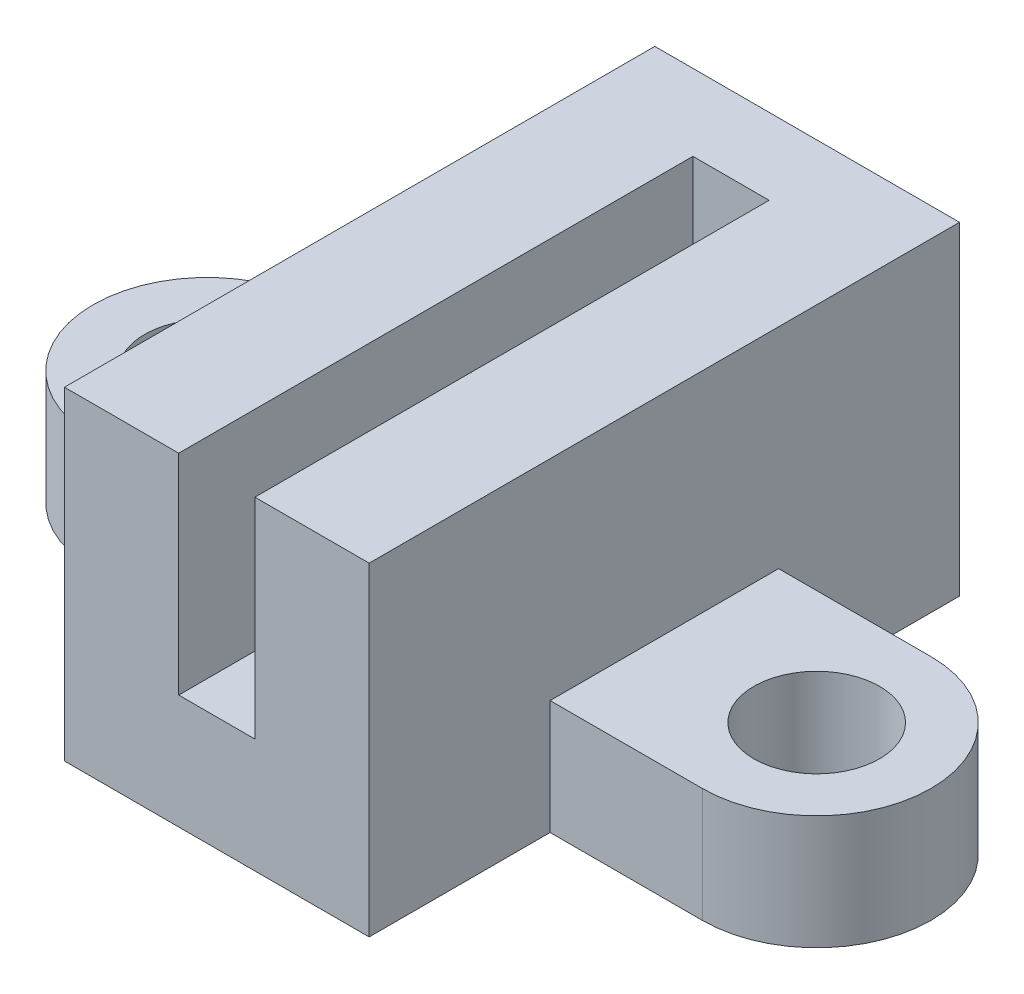
ISO-10303-21;
HEADER;
FILE_DESCRIPTION(('STEP AP214'),'2;1');
FILE_NAME('part.step','',(''),(''),'','','');
FILE_SCHEMA(('AUTOMOTIVE_DESIGN { 1 0 10303 214 1 1 1 1 }'));
ENDSEC;
DATA;
#1=APPLICATION_CONTEXT('core data for automotive mechanical design processes');
#2=APPLICATION_PROTOCOL_DEFINITION('international standard','automotive_design',2000,#1);
#3=PRODUCT_CONTEXT('',#1,'mechanical');
#4=PRODUCT('Part','Part','',(#3));
#5=PRODUCT_RELATED_PRODUCT_CATEGORY('part','',(#4));
#6=PRODUCT_DEFINITION_FORMATION('','',#4);
#7=PRODUCT_DEFINITION_CONTEXT('part definition',#1,'design');
#8=PRODUCT_DEFINITION('design','',#6,#7);
#9=PRODUCT_DEFINITION_SHAPE('','',#8);
#10=(LENGTH_UNIT() NAMED_UNIT(*) SI_UNIT(.MILLI.,.METRE.));
#11=(NAMED_UNIT(*) PLANE_ANGLE_UNIT() SI_UNIT($,.RADIAN.));
#12=(NAMED_UNIT(*) SI_UNIT($,.STERADIAN.) SOLID_ANGLE_UNIT());
#13=UNCERTAINTY_MEASURE_WITH_UNIT(LENGTH_MEASURE(1.E-05),#10,'distance_accuracy_value','');
#14=(GEOMETRIC_REPRESENTATION_CONTEXT(3) GLOBAL_UNCERTAINTY_ASSIGNED_CONTEXT((#13)) GLOBAL_UNIT_ASSIGNED_CONTEXT((#10,
#11,#12)) REPRESENTATION_CONTEXT('',''));
#15=CARTESIAN_POINT('',(0.,0.,0.));
#16=DIRECTION('',(0.,0.,1.));
#17=DIRECTION('',(1.,0.,0.));
#18=AXIS2_PLACEMENT_3D('',#15,#16,#17);
#19=CARTESIAN_POINT('',(8.,8.5,13.5));
#20=DIRECTION('',(-1.,0.,0.));
#21=DIRECTION('',(0.,-1.,0.));
#22=AXIS2_PLACEMENT_3D('',#19,#20,#21);
#23=PLANE('',#22);
#24=DIRECTION('',(0.,-1.,0.));
#25=VECTOR('',#24,1.);
#26=CARTESIAN_POINT('',(8.,3.,8.75));
#27=LINE('',#26,#25);
#28=CARTESIAN_POINT('',(8.,3.,8.75));
#29=VERTEX_POINT('',#28);
#30=CARTESIAN_POINT('',(8.,0.,8.75));
#31=VERTEX_POINT('',#30);
#32=EDGE_CURVE('E154',#29,#31,#27,.T.);
#33=ORIENTED_EDGE('',*,*,#32,.F.);
#34=DIRECTION('',(0.,0.,1.));
#35=VECTOR('',#34,1.);
#36=CARTESIAN_POINT('',(8.,3.,8.75));
#37=LINE('',#36,#35);
#38=CARTESIAN_POINT('',(8.,3.,2.75));
#39=VERTEX_POINT('',#38);
#40=EDGE_CURVE('E160',#39,#29,#37,.T.);
#41=ORIENTED_EDGE('',*,*,#40,.F.);
#42=DIRECTION('',(0.,-1.,0.));
#43=VECTOR('',#42,1.);
#44=CARTESIAN_POINT('',(8.,3.,2.75));
#45=LINE('',#44,#43);
#46=CARTESIAN_POINT('',(8.,0.,2.75));
#47=VERTEX_POINT('',#46);
#48=EDGE_CURVE('E271',#39,#47,#45,.T.);
#49=ORIENTED_EDGE('',*,*,#48,.T.);
#50=DIRECTION('',(0.,0.,-1.));
#51=VECTOR('',#50,1.);
#52=CARTESIAN_POINT('',(8.,0.,13.5));
#53=LINE('',#52,#51);
#54=CARTESIAN_POINT('',(8.,0.,-2.));
#55=VERTEX_POINT('',#54);
#56=EDGE_CURVE('E41',#47,#55,#53,.T.);
#57=ORIENTED_EDGE('',*,*,#56,.T.);
#58=DIRECTION('',(0.,-1.,0.));
#59=VECTOR('',#58,1.);
#60=CARTESIAN_POINT('',(8.,0.,-2.));
#61=LINE('',#60,#59);
#62=CARTESIAN_POINT('',(8.,8.5,-2.));
#63=VERTEX_POINT('',#62);
#64=EDGE_CURVE('E206',#63,#55,#61,.T.);
#65=ORIENTED_EDGE('',*,*,#64,.F.);
#66=DIRECTION('',(0.,0.,-1.));
#67=VECTOR('',#66,1.);
#68=CARTESIAN_POINT('',(8.,8.5,13.5));
#69=LINE('',#68,#67);
#70=CARTESIAN_POINT('',(8.,8.5,13.5));
#71=VERTEX_POINT('',#70);
#72=EDGE_CURVE('E263',#71,#63,#69,.T.);
#73=ORIENTED_EDGE('',*,*,#72,.F.);
#74=DIRECTION('',(0.,1.,0.));
#75=VECTOR('',#74,1.);
#76=CARTESIAN_POINT('',(8.,8.5,13.5));
#77=LINE('',#76,#75);
#78=CARTESIAN_POINT('',(8.,0.,13.5));
#79=VERTEX_POINT('',#78);
#80=EDGE_CURVE('E224',#79,#71,#77,.T.);
#81=ORIENTED_EDGE('',*,*,#80,.F.);
#82=EDGE_CURVE('E11',#79,#31,#53,.T.);
#83=ORIENTED_EDGE('',*,*,#82,.T.);
#84=EDGE_LOOP('',(#33,#41,#49,#57,#65,#73,#81,#83));
#85=FACE_BOUND('',#84,.T.);
#86=ADVANCED_FACE('F33',(#85),#23,.F.);
#87=CARTESIAN_POINT('',(0.,0.,13.5));
#88=DIRECTION('',(1.,0.,0.));
#89=DIRECTION('',(0.,0.,-1.));
#90=AXIS2_PLACEMENT_3D('',#87,#88,#89);
#91=PLANE('',#90);
#92=DIRECTION('',(0.,-1.,0.));
#93=VECTOR('',#92,1.);
#94=CARTESIAN_POINT('',(0.,3.,2.75));
#95=LINE('',#94,#93);
#96=CARTESIAN_POINT('',(0.,3.,2.75));
#97=VERTEX_POINT('',#96);
#98=CARTESIAN_POINT('',(0.,0.,2.75));
#99=VERTEX_POINT('',#98);
#100=EDGE_CURVE('E202',#97,#99,#95,.T.);
#101=ORIENTED_EDGE('',*,*,#100,.F.);
#102=DIRECTION('',(0.,0.,-1.));
#103=VECTOR('',#102,1.);
#104=CARTESIAN_POINT('',(0.,3.,2.75));
#105=LINE('',#104,#103);
#106=CARTESIAN_POINT('',(0.,3.,8.75));
#107=VERTEX_POINT('',#106);
#108=EDGE_CURVE('E182',#107,#97,#105,.T.);
#109=ORIENTED_EDGE('',*,*,#108,.F.);
#110=DIRECTION('',(0.,-1.,0.));
#111=VECTOR('',#110,1.);
#112=CARTESIAN_POINT('',(0.,3.,8.75));
#113=LINE('',#112,#111);
#114=CARTESIAN_POINT('',(0.,0.,8.75));
#115=VERTEX_POINT('',#114);
#116=EDGE_CURVE('E191',#107,#115,#113,.T.);
#117=ORIENTED_EDGE('',*,*,#116,.T.);
#118=DIRECTION('',(0.,0.,-1.));
#119=VECTOR('',#118,1.);
#120=CARTESIAN_POINT('',(0.,0.,13.5));
#121=LINE('',#120,#119);
#122=CARTESIAN_POINT('',(0.,0.,13.5));
#123=VERTEX_POINT('',#122);
#124=EDGE_CURVE('E247',#123,#115,#121,.T.);
#125=ORIENTED_EDGE('',*,*,#124,.F.);
#126=DIRECTION('',(0.,-1.,0.));
#127=VECTOR('',#126,1.);
#128=CARTESIAN_POINT('',(0.,0.,13.5));
#129=LINE('',#128,#127);
#130=CARTESIAN_POINT('',(0.,8.5,13.5));
#131=VERTEX_POINT('',#130);
#132=EDGE_CURVE('E237',#131,#123,#129,.T.);
#133=ORIENTED_EDGE('',*,*,#132,.F.);
#134=DIRECTION('',(0.,0.,-1.));
#135=VECTOR('',#134,1.);
#136=CARTESIAN_POINT('',(0.,8.5,13.5));
#137=LINE('',#136,#135);
#138=CARTESIAN_POINT('',(0.,8.5,-2.));
#139=VERTEX_POINT('',#138);
#140=EDGE_CURVE('E250',#131,#139,#137,.T.);
#141=ORIENTED_EDGE('',*,*,#140,.T.);
#142=DIRECTION('',(0.,1.,0.));
#143=VECTOR('',#142,1.);
#144=CARTESIAN_POINT('',(0.,0.,-2.));
#145=LINE('',#144,#143);
#146=CARTESIAN_POINT('',(0.,0.,-2.));
#147=VERTEX_POINT('',#146);
#148=EDGE_CURVE('E212',#147,#139,#145,.T.);
#149=ORIENTED_EDGE('',*,*,#148,.F.);
#150=EDGE_CURVE('E239',#99,#147,#121,.T.);
#151=ORIENTED_EDGE('',*,*,#150,.F.);
#152=EDGE_LOOP('',(#101,#109,#117,#125,#133,#141,#149,#151));
#153=FACE_BOUND('',#152,.T.);
#154=ADVANCED_FACE('F285',(#153),#91,.F.);
#155=CARTESIAN_POINT('',(8.,0.,13.5));
#156=DIRECTION('',(0.,1.,0.));
#157=DIRECTION('',(-1.,0.,0.));
#158=AXIS2_PLACEMENT_3D('',#155,#156,#157);
#159=PLANE('',#158);
#160=ORIENTED_EDGE('',*,*,#124,.T.);
#161=DIRECTION('',(1.,0.,0.));
#162=VECTOR('',#161,1.);
#163=CARTESIAN_POINT('',(-4.,0.,8.75));
#164=LINE('',#163,#162);
#165=CARTESIAN_POINT('',(-4.,0.,8.75));
#166=VERTEX_POINT('',#165);
#167=EDGE_CURVE('E56',#166,#115,#164,.T.);
#168=ORIENTED_EDGE('',*,*,#167,.F.);
#169=CARTESIAN_POINT('',(-4.,0.,5.75));
#170=DIRECTION('',(0.,1.,0.));
#171=DIRECTION('',(0.,0.,1.));
#172=AXIS2_PLACEMENT_3D('',#169,#170,#171);
#173=CIRCLE('',#172,3.);
#174=CARTESIAN_POINT('',(-4.,0.,2.75));
#175=VERTEX_POINT('',#174);
#176=EDGE_CURVE('E193',#175,#166,#173,.T.);
#177=ORIENTED_EDGE('',*,*,#176,.F.);
#178=DIRECTION('',(-1.,0.,0.));
#179=VECTOR('',#178,1.);
#180=CARTESIAN_POINT('',(0.,0.,2.75));
#181=LINE('',#180,#179);
#182=EDGE_CURVE('E180',#99,#175,#181,.T.);
#183=ORIENTED_EDGE('',*,*,#182,.F.);
#184=ORIENTED_EDGE('',*,*,#150,.T.);
#185=DIRECTION('',(-1.,0.,0.));
#186=VECTOR('',#185,1.);
#187=CARTESIAN_POINT('',(8.,0.,-2.));
#188=LINE('',#187,#186);
#189=EDGE_CURVE('E209',#55,#147,#188,.T.);
#190=ORIENTED_EDGE('',*,*,#189,.F.);
#191=ORIENTED_EDGE('',*,*,#56,.F.);
#192=DIRECTION('',(-1.,0.,0.));
#193=VECTOR('',#192,1.);
#194=CARTESIAN_POINT('',(8.,0.,2.75));
#195=LINE('',#194,#193);
#196=CARTESIAN_POINT('',(12.,0.,2.75));
#197=VERTEX_POINT('',#196);
#198=EDGE_CURVE('E48',#197,#47,#195,.T.);
#199=ORIENTED_EDGE('',*,*,#198,.F.);
#200=CARTESIAN_POINT('',(12.,0.,5.75));
#201=DIRECTION('',(0.,1.,0.));
#202=DIRECTION('',(0.,0.,-1.));
#203=AXIS2_PLACEMENT_3D('',#200,#201,#202);
#204=CIRCLE('',#203,3.);
#205=CARTESIAN_POINT('',(12.,0.,8.75));
#206=VERTEX_POINT('',#205);
#207=EDGE_CURVE('E504',#206,#197,#204,.T.);
#208=ORIENTED_EDGE('',*,*,#207,.F.);
#209=DIRECTION('',(1.,0.,0.));
#210=VECTOR('',#209,1.);
#211=CARTESIAN_POINT('',(12.,0.,8.75));
#212=LINE('',#211,#210);
#213=EDGE_CURVE('E498',#31,#206,#212,.T.);
#214=ORIENTED_EDGE('',*,*,#213,.F.);
#215=ORIENTED_EDGE('',*,*,#82,.F.);
#216=DIRECTION('',(1.,0.,0.));
#217=VECTOR('',#216,1.);
#218=CARTESIAN_POINT('',(8.,0.,13.5));
#219=LINE('',#218,#217);
#220=EDGE_CURVE('E221',#123,#79,#219,.T.);
#221=ORIENTED_EDGE('',*,*,#220,.F.);
#222=EDGE_LOOP('',(#160,#168,#177,#183,#184,#190,#191,#199,#208,#214,#215,#221));
#223=FACE_BOUND('',#222,.T.);
#224=CARTESIAN_POINT('',(-4.,0.,5.75));
#225=DIRECTION('',(0.,1.,0.));
#226=DIRECTION('',(0.,0.,1.));
#227=AXIS2_PLACEMENT_3D('',#224,#225,#226);
#228=CIRCLE('',#227,1.65);
#229=CARTESIAN_POINT('',(-4.,0.,7.4));
#230=VERTEX_POINT('',#229);
#231=EDGE_CURVE('E170',#230,#230,#228,.T.);
#232=ORIENTED_EDGE('',*,*,#231,.T.);
#233=EDGE_LOOP('',(#232));
#234=FACE_BOUND('',#233,.T.);
#235=CARTESIAN_POINT('',(12.,0.,5.75));
#236=DIRECTION('',(0.,1.,0.));
#237=DIRECTION('',(0.,0.,1.));
#238=AXIS2_PLACEMENT_3D('',#235,#236,#237);
#239=CIRCLE('',#238,1.65);
#240=CARTESIAN_POINT('',(12.,0.,7.4));
#241=VERTEX_POINT('',#240);
#242=EDGE_CURVE('E495',#241,#241,#239,.T.);
#243=ORIENTED_EDGE('',*,*,#242,.T.);
#244=EDGE_LOOP('',(#243));
#245=FACE_BOUND('',#244,.T.);
#246=ADVANCED_FACE('F35',(#223,#234,#245),#159,.F.);
#247=CARTESIAN_POINT('',(5.,3.,13.5));
#248=DIRECTION('',(1.,0.,0.));
#249=DIRECTION('',(0.,1.,0.));
#250=AXIS2_PLACEMENT_3D('',#247,#248,#249);
#251=PLANE('',#250);
#252=DIRECTION('',(0.,-1.,0.));
#253=VECTOR('',#252,1.);
#254=CARTESIAN_POINT('',(5.,3.,0.));
#255=LINE('',#254,#253);
#256=CARTESIAN_POINT('',(5.,8.5,0.));
#257=VERTEX_POINT('',#256);
#258=CARTESIAN_POINT('',(5.,3.,0.));
#259=VERTEX_POINT('',#258);
#260=EDGE_CURVE('E218',#257,#259,#255,.T.);
#261=ORIENTED_EDGE('',*,*,#260,.T.);
#262=DIRECTION('',(0.,0.,-1.));
#263=VECTOR('',#262,1.);
#264=CARTESIAN_POINT('',(5.,3.,13.5));
#265=LINE('',#264,#263);
#266=CARTESIAN_POINT('',(5.,3.,13.5));
#267=VERTEX_POINT('',#266);
#268=EDGE_CURVE('E258',#267,#259,#265,.T.);
#269=ORIENTED_EDGE('',*,*,#268,.F.);
#270=DIRECTION('',(0.,-1.,0.));
#271=VECTOR('',#270,1.);
#272=CARTESIAN_POINT('',(5.,3.,13.5));
#273=LINE('',#272,#271);
#274=CARTESIAN_POINT('',(5.,8.5,13.5));
#275=VERTEX_POINT('',#274);
#276=EDGE_CURVE('E229',#275,#267,#273,.T.);
#277=ORIENTED_EDGE('',*,*,#276,.F.);
#278=DIRECTION('',(0.,0.,-1.));
#279=VECTOR('',#278,1.);
#280=CARTESIAN_POINT('',(5.,8.5,13.5));
#281=LINE('',#280,#279);
#282=EDGE_CURVE('E261',#275,#257,#281,.T.);
#283=ORIENTED_EDGE('',*,*,#282,.T.);
#284=EDGE_LOOP('',(#261,#269,#277,#283));
#285=FACE_BOUND('',#284,.T.);
#286=ADVANCED_FACE('F299',(#285),#251,.F.);
#287=CARTESIAN_POINT('',(3.,3.,13.5));
#288=DIRECTION('',(0.,-1.,0.));
#289=DIRECTION('',(1.,0.,0.));
#290=AXIS2_PLACEMENT_3D('',#287,#288,#289);
#291=PLANE('',#290);
#292=DIRECTION('',(-1.,0.,0.));
#293=VECTOR('',#292,1.);
#294=CARTESIAN_POINT('',(3.,3.,0.));
#295=LINE('',#294,#293);
#296=CARTESIAN_POINT('',(3.,3.,0.));
#297=VERTEX_POINT('',#296);
#298=EDGE_CURVE('E242',#259,#297,#295,.T.);
#299=ORIENTED_EDGE('',*,*,#298,.T.);
#300=DIRECTION('',(0.,0.,-1.));
#301=VECTOR('',#300,1.);
#302=CARTESIAN_POINT('',(3.,3.,13.5));
#303=LINE('',#302,#301);
#304=CARTESIAN_POINT('',(3.,3.,13.5));
#305=VERTEX_POINT('',#304);
#306=EDGE_CURVE('E255',#305,#297,#303,.T.);
#307=ORIENTED_EDGE('',*,*,#306,.F.);
#308=DIRECTION('',(-1.,0.,0.));
#309=VECTOR('',#308,1.);
#310=CARTESIAN_POINT('',(3.,3.,13.5));
#311=LINE('',#310,#309);
#312=EDGE_CURVE('E231',#267,#305,#311,.T.);
#313=ORIENTED_EDGE('',*,*,#312,.F.);
#314=ORIENTED_EDGE('',*,*,#268,.T.);
#315=EDGE_LOOP('',(#299,#307,#313,#314));
#316=FACE_BOUND('',#315,.T.);
#317=ADVANCED_FACE('F302',(#316),#291,.F.);
#318=CARTESIAN_POINT('',(3.,8.5,13.5));
#319=DIRECTION('',(-1.,0.,0.));
#320=DIRECTION('',(0.,-1.,0.));
#321=AXIS2_PLACEMENT_3D('',#318,#319,#320);
#322=PLANE('',#321);
#323=DIRECTION('',(0.,1.,0.));
#324=VECTOR('',#323,1.);
#325=CARTESIAN_POINT('',(3.,8.5,0.));
#326=LINE('',#325,#324);
#327=CARTESIAN_POINT('',(3.,8.5,0.));
#328=VERTEX_POINT('',#327);
#329=EDGE_CURVE('E225',#297,#328,#326,.T.);
#330=ORIENTED_EDGE('',*,*,#329,.T.);
#331=DIRECTION('',(0.,0.,-1.));
#332=VECTOR('',#331,1.);
#333=CARTESIAN_POINT('',(3.,8.5,13.5));
#334=LINE('',#333,#332);
#335=CARTESIAN_POINT('',(3.,8.5,13.5));
#336=VERTEX_POINT('',#335);
#337=EDGE_CURVE('E252',#336,#328,#334,.T.);
#338=ORIENTED_EDGE('',*,*,#337,.F.);
#339=DIRECTION('',(0.,1.,0.));
#340=VECTOR('',#339,1.);
#341=CARTESIAN_POINT('',(3.,8.5,13.5));
#342=LINE('',#341,#340);
#343=EDGE_CURVE('E233',#305,#336,#342,.T.);
#344=ORIENTED_EDGE('',*,*,#343,.F.);
#345=ORIENTED_EDGE('',*,*,#306,.T.);
#346=EDGE_LOOP('',(#330,#338,#344,#345));
#347=FACE_BOUND('',#346,.T.);
#348=ADVANCED_FACE('F294',(#347),#322,.F.);
#349=CARTESIAN_POINT('',(0.,8.5,13.5));
#350=DIRECTION('',(0.,-1.,0.));
#351=DIRECTION('',(0.,0.,-1.));
#352=AXIS2_PLACEMENT_3D('',#349,#350,#351);
#353=PLANE('',#352);
#354=ORIENTED_EDGE('',*,*,#337,.T.);
#355=DIRECTION('',(1.,0.,0.));
#356=VECTOR('',#355,1.);
#357=CARTESIAN_POINT('',(8.,8.5,0.));
#358=LINE('',#357,#356);
#359=EDGE_CURVE('E205',#328,#257,#358,.T.);
#360=ORIENTED_EDGE('',*,*,#359,.T.);
#361=ORIENTED_EDGE('',*,*,#282,.F.);
#362=DIRECTION('',(-1.,0.,0.));
#363=VECTOR('',#362,1.);
#364=CARTESIAN_POINT('',(5.,8.5,13.5));
#365=LINE('',#364,#363);
#366=EDGE_CURVE('E227',#71,#275,#365,.T.);
#367=ORIENTED_EDGE('',*,*,#366,.F.);
#368=ORIENTED_EDGE('',*,*,#72,.T.);
#369=DIRECTION('',(1.,0.,0.));
#370=VECTOR('',#369,1.);
#371=CARTESIAN_POINT('',(8.,8.5,-2.));
#372=LINE('',#371,#370);
#373=EDGE_CURVE('E215',#139,#63,#372,.T.);
#374=ORIENTED_EDGE('',*,*,#373,.F.);
#375=ORIENTED_EDGE('',*,*,#140,.F.);
#376=DIRECTION('',(-1.,0.,0.));
#377=VECTOR('',#376,1.);
#378=CARTESIAN_POINT('',(0.,8.5,13.5));
#379=LINE('',#378,#377);
#380=EDGE_CURVE('E235',#336,#131,#379,.T.);
#381=ORIENTED_EDGE('',*,*,#380,.F.);
#382=EDGE_LOOP('',(#354,#360,#361,#367,#368,#374,#375,#381));
#383=FACE_BOUND('',#382,.T.);
#384=ADVANCED_FACE('F279',(#383),#353,.F.);
#385=CARTESIAN_POINT('',(0.,0.,13.5));
#386=DIRECTION('',(0.,0.,-1.));
#387=DIRECTION('',(-1.,0.,0.));
#388=AXIS2_PLACEMENT_3D('',#385,#386,#387);
#389=PLANE('',#388);
#390=ORIENTED_EDGE('',*,*,#220,.T.);
#391=ORIENTED_EDGE('',*,*,#80,.T.);
#392=ORIENTED_EDGE('',*,*,#366,.T.);
#393=ORIENTED_EDGE('',*,*,#276,.T.);
#394=ORIENTED_EDGE('',*,*,#312,.T.);
#395=ORIENTED_EDGE('',*,*,#343,.T.);
#396=ORIENTED_EDGE('',*,*,#380,.T.);
#397=ORIENTED_EDGE('',*,*,#132,.T.);
#398=EDGE_LOOP('',(#390,#391,#392,#393,#394,#395,#396,#397));
#399=FACE_BOUND('',#398,.T.);
#400=ADVANCED_FACE('F288',(#399),#389,.F.);
#401=CARTESIAN_POINT('',(0.,0.,0.));
#402=DIRECTION('',(0.,0.,1.));
#403=DIRECTION('',(1.,0.,0.));
#404=AXIS2_PLACEMENT_3D('',#401,#402,#403);
#405=PLANE('',#404);
#406=ORIENTED_EDGE('',*,*,#329,.F.);
#407=ORIENTED_EDGE('',*,*,#298,.F.);
#408=ORIENTED_EDGE('',*,*,#260,.F.);
#409=ORIENTED_EDGE('',*,*,#359,.F.);
#410=EDGE_LOOP('',(#406,#407,#408,#409));
#411=FACE_BOUND('',#410,.T.);
#412=ADVANCED_FACE('F303',(#411),#405,.T.);
#413=CARTESIAN_POINT('',(0.,0.,-2.));
#414=DIRECTION('',(0.,0.,1.));
#415=DIRECTION('',(1.,0.,0.));
#416=AXIS2_PLACEMENT_3D('',#413,#414,#415);
#417=PLANE('',#416);
#418=ORIENTED_EDGE('',*,*,#64,.T.);
#419=ORIENTED_EDGE('',*,*,#189,.T.);
#420=ORIENTED_EDGE('',*,*,#148,.T.);
#421=ORIENTED_EDGE('',*,*,#373,.T.);
#422=EDGE_LOOP('',(#418,#419,#420,#421));
#423=FACE_BOUND('',#422,.T.);
#424=ADVANCED_FACE('F277',(#423),#417,.F.);
#425=CARTESIAN_POINT('',(-4.,3.,5.75));
#426=DIRECTION('',(0.,1.,0.));
#427=DIRECTION('',(0.,0.,1.));
#428=AXIS2_PLACEMENT_3D('',#425,#426,#427);
#429=PLANE('',#428);
#430=ORIENTED_EDGE('',*,*,#108,.T.);
#431=DIRECTION('',(-1.,0.,0.));
#432=VECTOR('',#431,1.);
#433=CARTESIAN_POINT('',(0.,3.,2.75));
#434=LINE('',#433,#432);
#435=CARTESIAN_POINT('',(-4.,3.,2.75));
#436=VERTEX_POINT('',#435);
#437=EDGE_CURVE('E185',#97,#436,#434,.T.);
#438=ORIENTED_EDGE('',*,*,#437,.T.);
#439=CARTESIAN_POINT('',(-4.,3.,5.75));
#440=DIRECTION('',(0.,1.,0.));
#441=DIRECTION('',(0.,0.,1.));
#442=AXIS2_PLACEMENT_3D('',#439,#440,#441);
#443=CIRCLE('',#442,3.);
#444=CARTESIAN_POINT('',(-4.,3.,8.75));
#445=VERTEX_POINT('',#444);
#446=EDGE_CURVE('E187',#436,#445,#443,.T.);
#447=ORIENTED_EDGE('',*,*,#446,.T.);
#448=DIRECTION('',(1.,0.,0.));
#449=VECTOR('',#448,1.);
#450=CARTESIAN_POINT('',(-4.,3.,8.75));
#451=LINE('',#450,#449);
#452=EDGE_CURVE('E189',#445,#107,#451,.T.);
#453=ORIENTED_EDGE('',*,*,#452,.T.);
#454=EDGE_LOOP('',(#430,#438,#447,#453));
#455=FACE_BOUND('',#454,.T.);
#456=CARTESIAN_POINT('',(-4.,3.,5.75));
#457=DIRECTION('',(0.,1.,0.));
#458=DIRECTION('',(0.,0.,1.));
#459=AXIS2_PLACEMENT_3D('',#456,#457,#458);
#460=CIRCLE('',#459,1.65);
#461=CARTESIAN_POINT('',(-4.,3.,7.4));
#462=VERTEX_POINT('',#461);
#463=EDGE_CURVE('E173',#462,#462,#460,.T.);
#464=ORIENTED_EDGE('',*,*,#463,.F.);
#465=EDGE_LOOP('',(#464));
#466=FACE_BOUND('',#465,.T.);
#467=ADVANCED_FACE('F310',(#455,#466),#429,.T.);
#468=CARTESIAN_POINT('',(0.,3.,2.75));
#469=DIRECTION('',(0.,0.,1.));
#470=DIRECTION('',(1.,0.,0.));
#471=AXIS2_PLACEMENT_3D('',#468,#469,#470);
#472=PLANE('',#471);
#473=ORIENTED_EDGE('',*,*,#182,.T.);
#474=DIRECTION('',(0.,-1.,0.));
#475=VECTOR('',#474,1.);
#476=CARTESIAN_POINT('',(-4.,3.,2.75));
#477=LINE('',#476,#475);
#478=EDGE_CURVE('E199',#436,#175,#477,.T.);
#479=ORIENTED_EDGE('',*,*,#478,.F.);
#480=ORIENTED_EDGE('',*,*,#437,.F.);
#481=ORIENTED_EDGE('',*,*,#100,.T.);
#482=EDGE_LOOP('',(#473,#479,#480,#481));
#483=FACE_BOUND('',#482,.T.);
#484=ADVANCED_FACE('F401',(#483),#472,.F.);
#485=CARTESIAN_POINT('',(-4.,3.,5.75));
#486=DIRECTION('',(0.,-1.,0.));
#487=DIRECTION('',(0.,0.,-1.));
#488=AXIS2_PLACEMENT_3D('',#485,#486,#487);
#489=CYLINDRICAL_SURFACE('',#488,3.);
#490=ORIENTED_EDGE('',*,*,#176,.T.);
#491=DIRECTION('',(0.,-1.,0.));
#492=VECTOR('',#491,1.);
#493=CARTESIAN_POINT('',(-4.,3.,8.75));
#494=LINE('',#493,#492);
#495=EDGE_CURVE('E197',#445,#166,#494,.T.);
#496=ORIENTED_EDGE('',*,*,#495,.F.);
#497=ORIENTED_EDGE('',*,*,#446,.F.);
#498=ORIENTED_EDGE('',*,*,#478,.T.);
#499=EDGE_LOOP('',(#490,#496,#497,#498));
#500=FACE_BOUND('',#499,.T.);
#501=ADVANCED_FACE('F411',(#500),#489,.T.);
#502=CARTESIAN_POINT('',(-4.,3.,8.75));
#503=DIRECTION('',(0.,0.,-1.));
#504=DIRECTION('',(-1.,0.,0.));
#505=AXIS2_PLACEMENT_3D('',#502,#503,#504);
#506=PLANE('',#505);
#507=ORIENTED_EDGE('',*,*,#167,.T.);
#508=ORIENTED_EDGE('',*,*,#116,.F.);
#509=ORIENTED_EDGE('',*,*,#452,.F.);
#510=ORIENTED_EDGE('',*,*,#495,.T.);
#511=EDGE_LOOP('',(#507,#508,#509,#510));
#512=FACE_BOUND('',#511,.T.);
#513=ADVANCED_FACE('F421',(#512),#506,.F.);
#514=CARTESIAN_POINT('',(-4.,3.,5.75));
#515=DIRECTION('',(0.,-1.,0.));
#516=DIRECTION('',(0.,0.,-1.));
#517=AXIS2_PLACEMENT_3D('',#514,#515,#516);
#518=CYLINDRICAL_SURFACE('',#517,1.65);
#519=ORIENTED_EDGE('',*,*,#463,.T.);
#520=EDGE_LOOP('',(#519));
#521=FACE_BOUND('',#520,.T.);
#522=ORIENTED_EDGE('',*,*,#231,.F.);
#523=EDGE_LOOP('',(#522));
#524=FACE_BOUND('',#523,.T.);
#525=ADVANCED_FACE('F431',(#521,#524),#518,.F.);
#526=CARTESIAN_POINT('',(12.,3.,5.75));
#527=DIRECTION('',(0.,-1.,0.));
#528=DIRECTION('',(0.,0.,-1.));
#529=AXIS2_PLACEMENT_3D('',#526,#527,#528);
#530=PLANE('',#529);
#531=ORIENTED_EDGE('',*,*,#40,.T.);
#532=DIRECTION('',(1.,0.,0.));
#533=VECTOR('',#532,1.);
#534=CARTESIAN_POINT('',(12.,3.,8.75));
#535=LINE('',#534,#533);
#536=CARTESIAN_POINT('',(12.,3.,8.75));
#537=VERTEX_POINT('',#536);
#538=EDGE_CURVE('E150',#29,#537,#535,.T.);
#539=ORIENTED_EDGE('',*,*,#538,.T.);
#540=CARTESIAN_POINT('',(12.,3.,5.75));
#541=DIRECTION('',(0.,1.,0.));
#542=DIRECTION('',(0.,0.,-1.));
#543=AXIS2_PLACEMENT_3D('',#540,#541,#542);
#544=CIRCLE('',#543,3.);
#545=CARTESIAN_POINT('',(12.,3.,2.75));
#546=VERTEX_POINT('',#545);
#547=EDGE_CURVE('E159',#537,#546,#544,.T.);
#548=ORIENTED_EDGE('',*,*,#547,.T.);
#549=DIRECTION('',(-1.,0.,0.));
#550=VECTOR('',#549,1.);
#551=CARTESIAN_POINT('',(8.,3.,2.75));
#552=LINE('',#551,#550);
#553=EDGE_CURVE('E166',#546,#39,#552,.T.);
#554=ORIENTED_EDGE('',*,*,#553,.T.);
#555=EDGE_LOOP('',(#531,#539,#548,#554));
#556=FACE_BOUND('',#555,.T.);
#557=CARTESIAN_POINT('',(12.,3.,5.75));
#558=DIRECTION('',(0.,1.,0.));
#559=DIRECTION('',(0.,0.,1.));
#560=AXIS2_PLACEMENT_3D('',#557,#558,#559);
#561=CIRCLE('',#560,1.65);
#562=CARTESIAN_POINT('',(12.,3.,7.4));
#563=VERTEX_POINT('',#562);
#564=EDGE_CURVE('E492',#563,#563,#561,.T.);
#565=ORIENTED_EDGE('',*,*,#564,.F.);
#566=EDGE_LOOP('',(#565));
#567=FACE_BOUND('',#566,.T.);
#568=ADVANCED_FACE('F163',(#556,#567),#530,.F.);
#569=CARTESIAN_POINT('',(12.,3.,8.75));
#570=DIRECTION('',(0.,0.,-1.));
#571=DIRECTION('',(-1.,0.,0.));
#572=AXIS2_PLACEMENT_3D('',#569,#570,#571);
#573=PLANE('',#572);
#574=ORIENTED_EDGE('',*,*,#213,.T.);
#575=DIRECTION('',(0.,-1.,0.));
#576=VECTOR('',#575,1.);
#577=CARTESIAN_POINT('',(12.,3.,8.75));
#578=LINE('',#577,#576);
#579=EDGE_CURVE('E156',#537,#206,#578,.T.);
#580=ORIENTED_EDGE('',*,*,#579,.F.);
#581=ORIENTED_EDGE('',*,*,#538,.F.);
#582=ORIENTED_EDGE('',*,*,#32,.T.);
#583=EDGE_LOOP('',(#574,#580,#581,#582));
#584=FACE_BOUND('',#583,.T.);
#585=ADVANCED_FACE('F152',(#584),#573,.F.);
#586=CARTESIAN_POINT('',(12.,3.,5.75));
#587=DIRECTION('',(0.,-1.,0.));
#588=DIRECTION('',(0.,0.,-1.));
#589=AXIS2_PLACEMENT_3D('',#586,#587,#588);
#590=CYLINDRICAL_SURFACE('',#589,3.);
#591=ORIENTED_EDGE('',*,*,#207,.T.);
#592=DIRECTION('',(0.,-1.,0.));
#593=VECTOR('',#592,1.);
#594=CARTESIAN_POINT('',(12.,3.,2.75));
#595=LINE('',#594,#593);
#596=EDGE_CURVE('E175',#546,#197,#595,.T.);
#597=ORIENTED_EDGE('',*,*,#596,.F.);
#598=ORIENTED_EDGE('',*,*,#547,.F.);
#599=ORIENTED_EDGE('',*,*,#579,.T.);
#600=EDGE_LOOP('',(#591,#597,#598,#599));
#601=FACE_BOUND('',#600,.T.);
#602=ADVANCED_FACE('F457',(#601),#590,.T.);
#603=CARTESIAN_POINT('',(8.,3.,2.75));
#604=DIRECTION('',(0.,0.,1.));
#605=DIRECTION('',(1.,0.,0.));
#606=AXIS2_PLACEMENT_3D('',#603,#604,#605);
#607=PLANE('',#606);
#608=ORIENTED_EDGE('',*,*,#198,.T.);
#609=ORIENTED_EDGE('',*,*,#48,.F.);
#610=ORIENTED_EDGE('',*,*,#553,.F.);
#611=ORIENTED_EDGE('',*,*,#596,.T.);
#612=EDGE_LOOP('',(#608,#609,#610,#611));
#613=FACE_BOUND('',#612,.T.);
#614=ADVANCED_FACE('F466',(#613),#607,.F.);
#615=CARTESIAN_POINT('',(12.,3.,5.75));
#616=DIRECTION('',(0.,-1.,0.));
#617=DIRECTION('',(0.,0.,-1.));
#618=AXIS2_PLACEMENT_3D('',#615,#616,#617);
#619=CYLINDRICAL_SURFACE('',#618,1.65);
#620=ORIENTED_EDGE('',*,*,#564,.T.);
#621=EDGE_LOOP('',(#620));
#622=FACE_BOUND('',#621,.T.);
#623=ORIENTED_EDGE('',*,*,#242,.F.);
#624=EDGE_LOOP('',(#623));
#625=FACE_BOUND('',#624,.T.);
#626=ADVANCED_FACE('F476',(#622,#625),#619,.F.);
#627=CLOSED_SHELL('',(#86,#154,#246,#286,#317,#348,#384,#400,#412,#424,#467,#484,#501,#513,#525,
#568,#585,#602,#614,#626));
#628=MANIFOLD_SOLID_BREP('B2',#627);
#629=ADVANCED_BREP_SHAPE_REPRESENTATION('',(#18,#628),#14);
#630=SHAPE_DEFINITION_REPRESENTATION(#9,#629);
ENDSEC;
END-ISO-10303-21;
